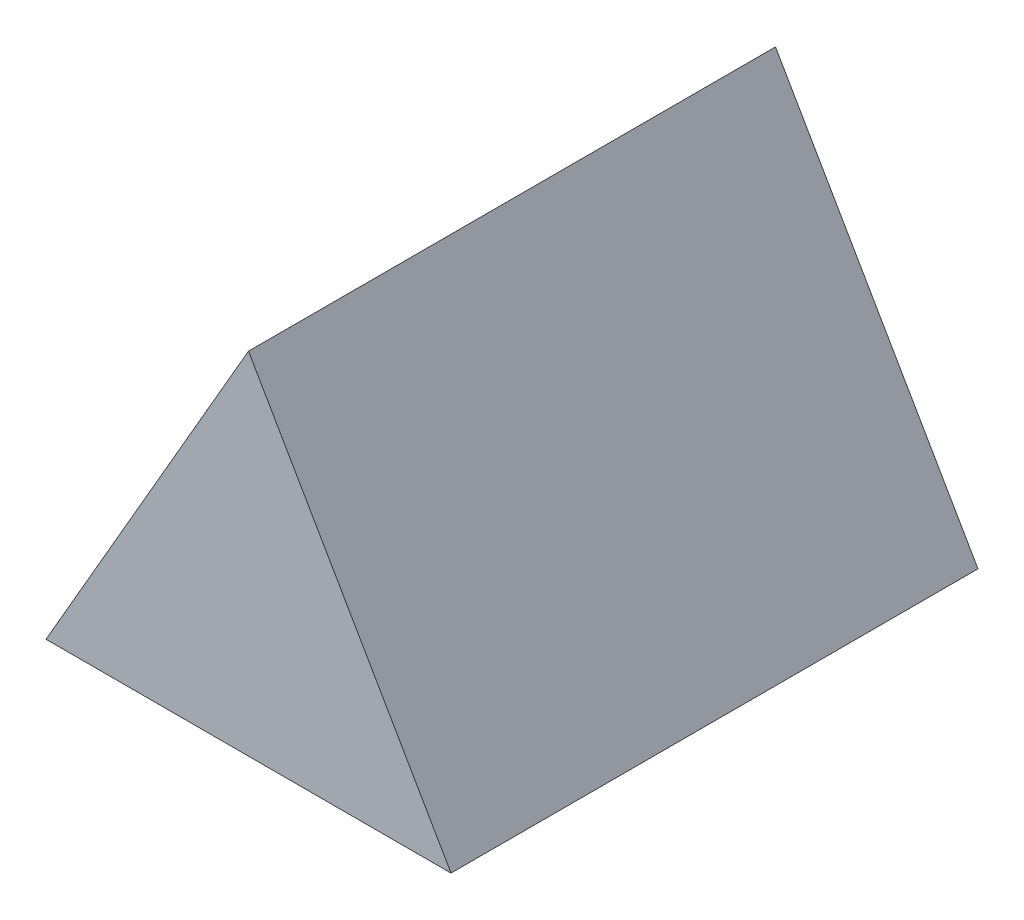
ISO-10303-21;
HEADER;
FILE_DESCRIPTION(('STEP AP214'),'2;1');
FILE_NAME('part.step','',(''),(''),'','','');
FILE_SCHEMA(('AUTOMOTIVE_DESIGN { 1 0 10303 214 1 1 1 1 }'));
ENDSEC;
DATA;
#1=APPLICATION_CONTEXT('core data for automotive mechanical design processes');
#2=APPLICATION_PROTOCOL_DEFINITION('international standard','automotive_design',2000,#1);
#3=PRODUCT_CONTEXT('',#1,'mechanical');
#4=PRODUCT('Part','Part','',(#3));
#5=PRODUCT_RELATED_PRODUCT_CATEGORY('part','',(#4));
#6=PRODUCT_DEFINITION_FORMATION('','',#4);
#7=PRODUCT_DEFINITION_CONTEXT('part definition',#1,'design');
#8=PRODUCT_DEFINITION('design','',#6,#7);
#9=PRODUCT_DEFINITION_SHAPE('','',#8);
#10=(LENGTH_UNIT() NAMED_UNIT(*) SI_UNIT(.MILLI.,.METRE.));
#11=(NAMED_UNIT(*) PLANE_ANGLE_UNIT() SI_UNIT($,.RADIAN.));
#12=(NAMED_UNIT(*) SI_UNIT($,.STERADIAN.) SOLID_ANGLE_UNIT());
#13=UNCERTAINTY_MEASURE_WITH_UNIT(LENGTH_MEASURE(1.E-05),#10,'distance_accuracy_value','');
#14=(GEOMETRIC_REPRESENTATION_CONTEXT(3) GLOBAL_UNCERTAINTY_ASSIGNED_CONTEXT((#13)) GLOBAL_UNIT_ASSIGNED_CONTEXT((#10,
#11,#12)) REPRESENTATION_CONTEXT('',''));
#15=CARTESIAN_POINT('',(0.,0.,0.));
#16=DIRECTION('',(0.,0.,1.));
#17=DIRECTION('',(1.,0.,0.));
#18=AXIS2_PLACEMENT_3D('',#15,#16,#17);
#19=CARTESIAN_POINT('',(61.4878036686952,-35.5,160.));
#20=DIRECTION('',(-0.866025403784438,-0.5,0.));
#21=DIRECTION('',(0.5,-0.866025403784438,0.));
#22=AXIS2_PLACEMENT_3D('',#19,#20,#21);
#23=PLANE('',#22);
#24=DIRECTION('',(-0.5,0.866025403784438,0.));
#25=VECTOR('',#24,1.);
#26=CARTESIAN_POINT('',(61.4878036686952,-35.5,0.));
#27=LINE('',#26,#25);
#28=CARTESIAN_POINT('',(61.4878036686952,-35.5,0.));
#29=VERTEX_POINT('',#28);
#30=CARTESIAN_POINT('',(0.,71.,0.));
#31=VERTEX_POINT('',#30);
#32=EDGE_CURVE('E80',#29,#31,#27,.T.);
#33=ORIENTED_EDGE('',*,*,#32,.T.);
#34=DIRECTION('',(0.,0.,-1.));
#35=VECTOR('',#34,1.);
#36=CARTESIAN_POINT('',(0.,71.,160.));
#37=LINE('',#36,#35);
#38=CARTESIAN_POINT('',(0.,71.,160.));
#39=VERTEX_POINT('',#38);
#40=EDGE_CURVE('E11',#39,#31,#37,.T.);
#41=ORIENTED_EDGE('',*,*,#40,.F.);
#42=DIRECTION('',(-0.5,0.866025403784438,0.));
#43=VECTOR('',#42,1.);
#44=CARTESIAN_POINT('',(61.4878036686952,-35.5,160.));
#45=LINE('',#44,#43);
#46=CARTESIAN_POINT('',(61.4878036686952,-35.5,160.));
#47=VERTEX_POINT('',#46);
#48=EDGE_CURVE('E73',#47,#39,#45,.T.);
#49=ORIENTED_EDGE('',*,*,#48,.F.);
#50=DIRECTION('',(0.,0.,-1.));
#51=VECTOR('',#50,1.);
#52=CARTESIAN_POINT('',(61.4878036686952,-35.5,160.));
#53=LINE('',#52,#51);
#54=EDGE_CURVE('E81',#47,#29,#53,.T.);
#55=ORIENTED_EDGE('',*,*,#54,.T.);
#56=EDGE_LOOP('',(#33,#41,#49,#55));
#57=FACE_BOUND('',#56,.T.);
#58=ADVANCED_FACE('F33',(#57),#23,.F.);
#59=CARTESIAN_POINT('',(0.,71.,160.));
#60=DIRECTION('',(0.866025403784439,-0.5,0.));
#61=DIRECTION('',(0.5,0.866025403784439,0.));
#62=AXIS2_PLACEMENT_3D('',#59,#60,#61);
#63=PLANE('',#62);
#64=DIRECTION('',(-0.5,-0.866025403784439,0.));
#65=VECTOR('',#64,1.);
#66=CARTESIAN_POINT('',(0.,71.,0.));
#67=LINE('',#66,#65);
#68=CARTESIAN_POINT('',(-61.4878036686951,-35.5,0.));
#69=VERTEX_POINT('',#68);
#70=EDGE_CURVE('E61',#31,#69,#67,.T.);
#71=ORIENTED_EDGE('',*,*,#70,.T.);
#72=DIRECTION('',(0.,0.,-1.));
#73=VECTOR('',#72,1.);
#74=CARTESIAN_POINT('',(-61.4878036686951,-35.5,160.));
#75=LINE('',#74,#73);
#76=CARTESIAN_POINT('',(-61.4878036686951,-35.5,160.));
#77=VERTEX_POINT('',#76);
#78=EDGE_CURVE('E41',#77,#69,#75,.T.);
#79=ORIENTED_EDGE('',*,*,#78,.F.);
#80=DIRECTION('',(-0.5,-0.866025403784439,0.));
#81=VECTOR('',#80,1.);
#82=CARTESIAN_POINT('',(0.,71.,160.));
#83=LINE('',#82,#81);
#84=EDGE_CURVE('E69',#39,#77,#83,.T.);
#85=ORIENTED_EDGE('',*,*,#84,.F.);
#86=ORIENTED_EDGE('',*,*,#40,.T.);
#87=EDGE_LOOP('',(#71,#79,#85,#86));
#88=FACE_BOUND('',#87,.T.);
#89=ADVANCED_FACE('F70',(#88),#63,.F.);
#90=CARTESIAN_POINT('',(-61.4878036686951,-35.5,160.));
#91=DIRECTION('',(0.,1.,0.));
#92=DIRECTION('',(0.,0.,1.));
#93=AXIS2_PLACEMENT_3D('',#90,#91,#92);
#94=PLANE('',#93);
#95=DIRECTION('',(1.,0.,0.));
#96=VECTOR('',#95,1.);
#97=CARTESIAN_POINT('',(-61.4878036686951,-35.5,0.));
#98=LINE('',#97,#96);
#99=EDGE_CURVE('E66',#69,#29,#98,.T.);
#100=ORIENTED_EDGE('',*,*,#99,.T.);
#101=ORIENTED_EDGE('',*,*,#54,.F.);
#102=DIRECTION('',(1.,0.,0.));
#103=VECTOR('',#102,1.);
#104=CARTESIAN_POINT('',(-61.4878036686951,-35.5,160.));
#105=LINE('',#104,#103);
#106=EDGE_CURVE('E49',#77,#47,#105,.T.);
#107=ORIENTED_EDGE('',*,*,#106,.F.);
#108=ORIENTED_EDGE('',*,*,#78,.T.);
#109=EDGE_LOOP('',(#100,#101,#107,#108));
#110=FACE_BOUND('',#109,.T.);
#111=ADVANCED_FACE('F88',(#110),#94,.F.);
#112=CARTESIAN_POINT('',(0.,0.,160.));
#113=DIRECTION('',(0.,0.,1.));
#114=DIRECTION('',(1.,0.,0.));
#115=AXIS2_PLACEMENT_3D('',#112,#113,#114);
#116=PLANE('',#115);
#117=ORIENTED_EDGE('',*,*,#48,.T.);
#118=ORIENTED_EDGE('',*,*,#84,.T.);
#119=ORIENTED_EDGE('',*,*,#106,.T.);
#120=EDGE_LOOP('',(#117,#118,#119));
#121=FACE_BOUND('',#120,.T.);
#122=ADVANCED_FACE('F76',(#121),#116,.T.);
#123=CARTESIAN_POINT('',(0.,0.,0.));
#124=DIRECTION('',(0.,0.,1.));
#125=DIRECTION('',(1.,0.,0.));
#126=AXIS2_PLACEMENT_3D('',#123,#124,#125);
#127=PLANE('',#126);
#128=ORIENTED_EDGE('',*,*,#32,.F.);
#129=ORIENTED_EDGE('',*,*,#99,.F.);
#130=ORIENTED_EDGE('',*,*,#70,.F.);
#131=EDGE_LOOP('',(#128,#129,#130));
#132=FACE_BOUND('',#131,.T.);
#133=ADVANCED_FACE('F89',(#132),#127,.F.);
#134=CLOSED_SHELL('',(#58,#89,#111,#122,#133));
#135=MANIFOLD_SOLID_BREP('B2',#134);
#136=ADVANCED_BREP_SHAPE_REPRESENTATION('',(#18,#135),#14);
#137=SHAPE_DEFINITION_REPRESENTATION(#9,#136);
ENDSEC;
END-ISO-10303-21;
